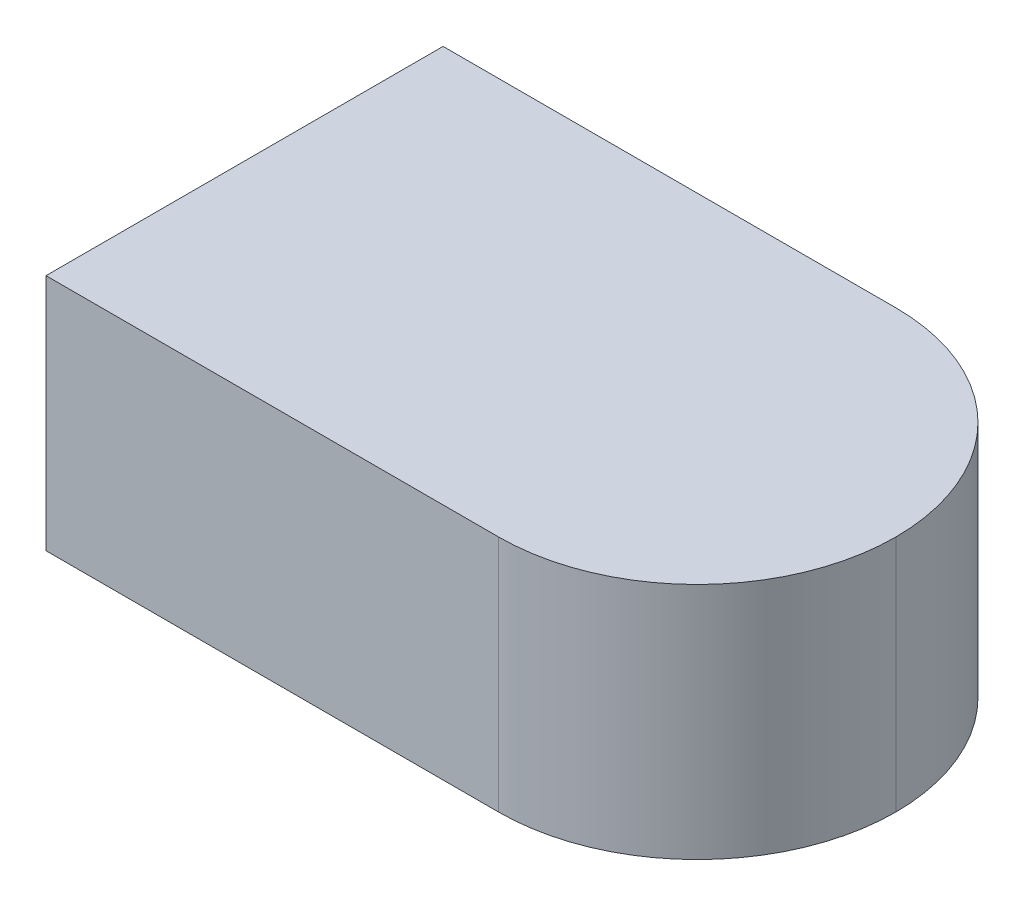
ISO-10303-21;
HEADER;
FILE_DESCRIPTION(('STEP AP214'),'2;1');
FILE_NAME('part.step','',(''),(''),'','','');
FILE_SCHEMA(('AUTOMOTIVE_DESIGN { 1 0 10303 214 1 1 1 1 }'));
ENDSEC;
DATA;
#1=APPLICATION_CONTEXT('core data for automotive mechanical design processes');
#2=APPLICATION_PROTOCOL_DEFINITION('international standard','automotive_design',2000,#1);
#3=PRODUCT_CONTEXT('',#1,'mechanical');
#4=PRODUCT('Part','Part','',(#3));
#5=PRODUCT_RELATED_PRODUCT_CATEGORY('part','',(#4));
#6=PRODUCT_DEFINITION_FORMATION('','',#4);
#7=PRODUCT_DEFINITION_CONTEXT('part definition',#1,'design');
#8=PRODUCT_DEFINITION('design','',#6,#7);
#9=PRODUCT_DEFINITION_SHAPE('','',#8);
#10=(LENGTH_UNIT() NAMED_UNIT(*) SI_UNIT(.MILLI.,.METRE.));
#11=(NAMED_UNIT(*) PLANE_ANGLE_UNIT() SI_UNIT($,.RADIAN.));
#12=(NAMED_UNIT(*) SI_UNIT($,.STERADIAN.) SOLID_ANGLE_UNIT());
#13=UNCERTAINTY_MEASURE_WITH_UNIT(LENGTH_MEASURE(1.E-05),#10,'distance_accuracy_value','');
#14=(GEOMETRIC_REPRESENTATION_CONTEXT(3) GLOBAL_UNCERTAINTY_ASSIGNED_CONTEXT((#13)) GLOBAL_UNIT_ASSIGNED_CONTEXT((#10,
#11,#12)) REPRESENTATION_CONTEXT('',''));
#15=CARTESIAN_POINT('',(0.,0.,0.));
#16=DIRECTION('',(0.,0.,1.));
#17=DIRECTION('',(1.,0.,0.));
#18=AXIS2_PLACEMENT_3D('',#15,#16,#17);
#19=CARTESIAN_POINT('',(-0.205,0.15,-0.125));
#20=DIRECTION('',(0.,0.,1.));
#21=DIRECTION('',(1.,0.,0.));
#22=AXIS2_PLACEMENT_3D('',#19,#20,#21);
#23=PLANE('',#22);
#24=DIRECTION('',(-1.,0.,0.));
#25=VECTOR('',#24,1.);
#26=CARTESIAN_POINT('',(-0.205,0.15,-0.125));
#27=LINE('',#26,#25);
#28=CARTESIAN_POINT('',(0.08,0.15,-0.125));
#29=VERTEX_POINT('',#28);
#30=CARTESIAN_POINT('',(-0.205,0.15,-0.125));
#31=VERTEX_POINT('',#30);
#32=EDGE_CURVE('E86',#29,#31,#27,.T.);
#33=ORIENTED_EDGE('',*,*,#32,.F.);
#34=DIRECTION('',(0.,-1.,0.));
#35=VECTOR('',#34,1.);
#36=CARTESIAN_POINT('',(0.08,0.15,-0.125));
#37=LINE('',#36,#35);
#38=CARTESIAN_POINT('',(0.08,0.,-0.125));
#39=VERTEX_POINT('',#38);
#40=EDGE_CURVE('E106',#29,#39,#37,.T.);
#41=ORIENTED_EDGE('',*,*,#40,.T.);
#42=DIRECTION('',(-1.,0.,0.));
#43=VECTOR('',#42,1.);
#44=CARTESIAN_POINT('',(-0.205,0.,-0.125));
#45=LINE('',#44,#43);
#46=CARTESIAN_POINT('',(-0.205,0.,-0.125));
#47=VERTEX_POINT('',#46);
#48=EDGE_CURVE('E102',#39,#47,#45,.T.);
#49=ORIENTED_EDGE('',*,*,#48,.T.);
#50=DIRECTION('',(0.,-1.,0.));
#51=VECTOR('',#50,1.);
#52=CARTESIAN_POINT('',(-0.205,0.15,-0.125));
#53=LINE('',#52,#51);
#54=EDGE_CURVE('E100',#31,#47,#53,.T.);
#55=ORIENTED_EDGE('',*,*,#54,.F.);
#56=EDGE_LOOP('',(#33,#41,#49,#55));
#57=FACE_BOUND('',#56,.T.);
#58=ADVANCED_FACE('F39',(#57),#23,.F.);
#59=CARTESIAN_POINT('',(-0.205,0.15,0.125));
#60=DIRECTION('',(1.,0.,0.));
#61=DIRECTION('',(0.,0.,-1.));
#62=AXIS2_PLACEMENT_3D('',#59,#60,#61);
#63=PLANE('',#62);
#64=DIRECTION('',(0.,0.,1.));
#65=VECTOR('',#64,1.);
#66=CARTESIAN_POINT('',(-0.205,0.,0.125));
#67=LINE('',#66,#65);
#68=CARTESIAN_POINT('',(-0.205,0.,0.125));
#69=VERTEX_POINT('',#68);
#70=EDGE_CURVE('E119',#47,#69,#67,.T.);
#71=ORIENTED_EDGE('',*,*,#70,.T.);
#72=DIRECTION('',(0.,-1.,0.));
#73=VECTOR('',#72,1.);
#74=CARTESIAN_POINT('',(-0.205,0.15,0.125));
#75=LINE('',#74,#73);
#76=CARTESIAN_POINT('',(-0.205,0.15,0.125));
#77=VERTEX_POINT('',#76);
#78=EDGE_CURVE('E107',#77,#69,#75,.T.);
#79=ORIENTED_EDGE('',*,*,#78,.F.);
#80=DIRECTION('',(0.,0.,1.));
#81=VECTOR('',#80,1.);
#82=CARTESIAN_POINT('',(-0.205,0.15,0.125));
#83=LINE('',#82,#81);
#84=EDGE_CURVE('E90',#31,#77,#83,.T.);
#85=ORIENTED_EDGE('',*,*,#84,.F.);
#86=ORIENTED_EDGE('',*,*,#54,.T.);
#87=EDGE_LOOP('',(#71,#79,#85,#86));
#88=FACE_BOUND('',#87,.T.);
#89=ADVANCED_FACE('F109',(#88),#63,.F.);
#90=CARTESIAN_POINT('',(-0.205,0.15,0.125));
#91=DIRECTION('',(0.,0.,-1.));
#92=DIRECTION('',(-1.,0.,0.));
#93=AXIS2_PLACEMENT_3D('',#90,#91,#92);
#94=PLANE('',#93);
#95=DIRECTION('',(1.,0.,0.));
#96=VECTOR('',#95,1.);
#97=CARTESIAN_POINT('',(-0.205,0.,0.125));
#98=LINE('',#97,#96);
#99=CARTESIAN_POINT('',(0.08,0.,0.125));
#100=VERTEX_POINT('',#99);
#101=EDGE_CURVE('E97',#69,#100,#98,.T.);
#102=ORIENTED_EDGE('',*,*,#101,.T.);
#103=DIRECTION('',(0.,-1.,0.));
#104=VECTOR('',#103,1.);
#105=CARTESIAN_POINT('',(0.08,0.15,0.125));
#106=LINE('',#105,#104);
#107=CARTESIAN_POINT('',(0.08,0.15,0.125));
#108=VERTEX_POINT('',#107);
#109=EDGE_CURVE('E11',#100,#108,#106,.F.);
#110=ORIENTED_EDGE('',*,*,#109,.T.);
#111=DIRECTION('',(1.,0.,0.));
#112=VECTOR('',#111,1.);
#113=CARTESIAN_POINT('',(-0.205,0.15,0.125));
#114=LINE('',#113,#112);
#115=EDGE_CURVE('E112',#77,#108,#114,.T.);
#116=ORIENTED_EDGE('',*,*,#115,.F.);
#117=ORIENTED_EDGE('',*,*,#78,.T.);
#118=EDGE_LOOP('',(#102,#110,#116,#117));
#119=FACE_BOUND('',#118,.T.);
#120=ADVANCED_FACE('F155',(#119),#94,.F.);
#121=CARTESIAN_POINT('',(0.,0.15,0.));
#122=DIRECTION('',(0.,-1.,0.));
#123=DIRECTION('',(0.,0.,-1.));
#124=AXIS2_PLACEMENT_3D('',#121,#122,#123);
#125=PLANE('',#124);
#126=CARTESIAN_POINT('',(0.08,0.15,0.));
#127=DIRECTION('',(0.,-1.,0.));
#128=DIRECTION('',(0.,0.,-1.));
#129=AXIS2_PLACEMENT_3D('',#126,#127,#128);
#130=CIRCLE('',#129,0.125);
#131=CARTESIAN_POINT('',(0.205,0.15,0.));
#132=VERTEX_POINT('',#131);
#133=EDGE_CURVE('E61',#108,#132,#130,.F.);
#134=ORIENTED_EDGE('',*,*,#133,.T.);
#135=CARTESIAN_POINT('',(0.08,0.15,0.));
#136=DIRECTION('',(0.,-1.,0.));
#137=DIRECTION('',(0.,0.,-1.));
#138=AXIS2_PLACEMENT_3D('',#135,#136,#137);
#139=CIRCLE('',#138,0.125);
#140=EDGE_CURVE('E49',#132,#29,#139,.F.);
#141=ORIENTED_EDGE('',*,*,#140,.T.);
#142=ORIENTED_EDGE('',*,*,#32,.T.);
#143=ORIENTED_EDGE('',*,*,#84,.T.);
#144=ORIENTED_EDGE('',*,*,#115,.T.);
#145=EDGE_LOOP('',(#134,#141,#142,#143,#144));
#146=FACE_BOUND('',#145,.T.);
#147=ADVANCED_FACE('F88',(#146),#125,.F.);
#148=CARTESIAN_POINT('',(0.,0.,0.));
#149=DIRECTION('',(0.,-1.,0.));
#150=DIRECTION('',(0.,0.,-1.));
#151=AXIS2_PLACEMENT_3D('',#148,#149,#150);
#152=PLANE('',#151);
#153=ORIENTED_EDGE('',*,*,#48,.F.);
#154=CARTESIAN_POINT('',(0.08,0.,0.));
#155=DIRECTION('',(0.,-1.,0.));
#156=DIRECTION('',(0.,0.,-1.));
#157=AXIS2_PLACEMENT_3D('',#154,#155,#156);
#158=CIRCLE('',#157,0.125);
#159=CARTESIAN_POINT('',(0.205,0.,0.));
#160=VERTEX_POINT('',#159);
#161=EDGE_CURVE('E131',#39,#160,#158,.T.);
#162=ORIENTED_EDGE('',*,*,#161,.T.);
#163=CARTESIAN_POINT('',(0.08,0.,0.));
#164=DIRECTION('',(0.,-1.,0.));
#165=DIRECTION('',(0.,0.,-1.));
#166=AXIS2_PLACEMENT_3D('',#163,#164,#165);
#167=CIRCLE('',#166,0.125);
#168=EDGE_CURVE('E128',#160,#100,#167,.T.);
#169=ORIENTED_EDGE('',*,*,#168,.T.);
#170=ORIENTED_EDGE('',*,*,#101,.F.);
#171=ORIENTED_EDGE('',*,*,#70,.F.);
#172=EDGE_LOOP('',(#153,#162,#169,#170,#171));
#173=FACE_BOUND('',#172,.T.);
#174=ADVANCED_FACE('F139',(#173),#152,.T.);
#175=CARTESIAN_POINT('',(0.08,0.15,0.));
#176=DIRECTION('',(0.,-1.,0.));
#177=DIRECTION('',(0.,0.,-1.));
#178=AXIS2_PLACEMENT_3D('',#175,#176,#177);
#179=CYLINDRICAL_SURFACE('',#178,0.125);
#180=DIRECTION('',(0.,-1.,0.));
#181=VECTOR('',#180,1.);
#182=CARTESIAN_POINT('',(0.205,0.15,0.));
#183=LINE('',#182,#181);
#184=EDGE_CURVE('E43',#132,#160,#183,.T.);
#185=ORIENTED_EDGE('',*,*,#184,.F.);
#186=ORIENTED_EDGE('',*,*,#133,.F.);
#187=ORIENTED_EDGE('',*,*,#109,.F.);
#188=ORIENTED_EDGE('',*,*,#168,.F.);
#189=EDGE_LOOP('',(#185,#186,#187,#188));
#190=FACE_BOUND('',#189,.T.);
#191=ADVANCED_FACE('F41',(#190),#179,.T.);
#192=CARTESIAN_POINT('',(0.08,0.15,0.));
#193=DIRECTION('',(0.,-1.,0.));
#194=DIRECTION('',(0.,0.,-1.));
#195=AXIS2_PLACEMENT_3D('',#192,#193,#194);
#196=CYLINDRICAL_SURFACE('',#195,0.125);
#197=ORIENTED_EDGE('',*,*,#140,.F.);
#198=ORIENTED_EDGE('',*,*,#184,.T.);
#199=ORIENTED_EDGE('',*,*,#161,.F.);
#200=ORIENTED_EDGE('',*,*,#40,.F.);
#201=EDGE_LOOP('',(#197,#198,#199,#200));
#202=FACE_BOUND('',#201,.T.);
#203=ADVANCED_FACE('F144',(#202),#196,.T.);
#204=CLOSED_SHELL('',(#58,#89,#120,#147,#174,#191,#203));
#205=MANIFOLD_SOLID_BREP('B2',#204);
#206=ADVANCED_BREP_SHAPE_REPRESENTATION('',(#18,#205),#14);
#207=SHAPE_DEFINITION_REPRESENTATION(#9,#206);
ENDSEC;
END-ISO-10303-21;
